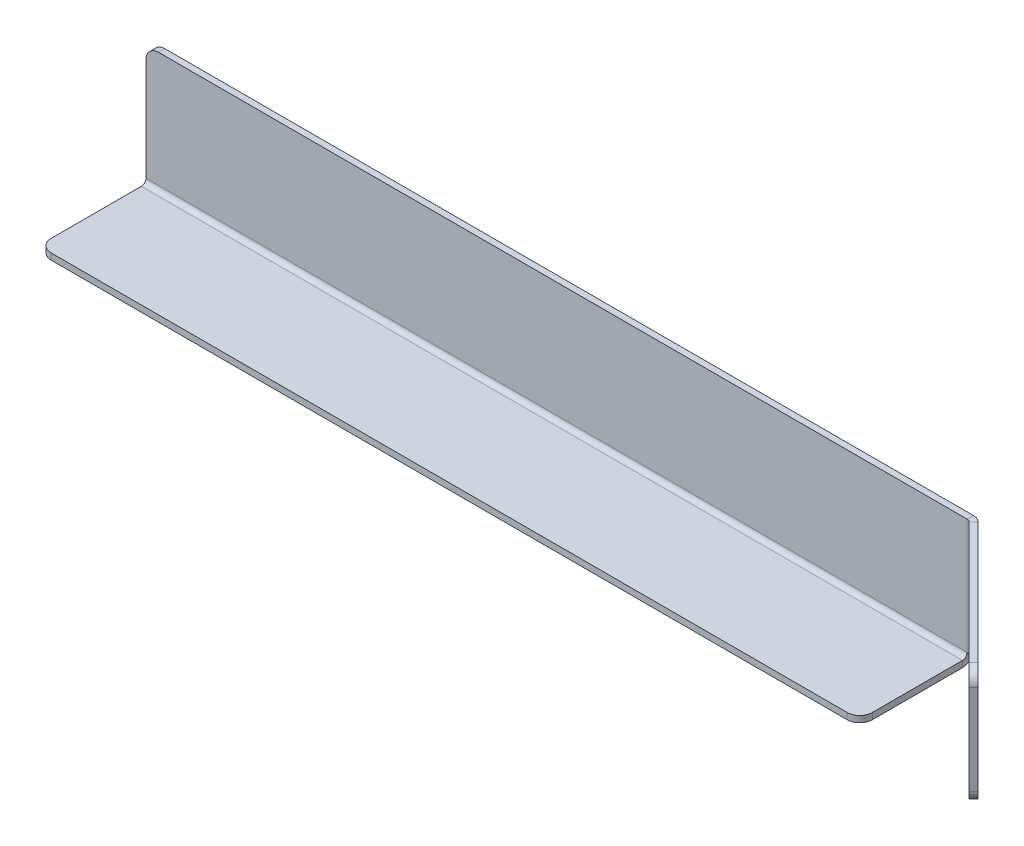
ISO-10303-21;
HEADER;
FILE_DESCRIPTION(('STEP AP214'),'2;1');
FILE_NAME('part.step','',(''),(''),'','','');
FILE_SCHEMA(('AUTOMOTIVE_DESIGN { 1 0 10303 214 1 1 1 1 }'));
ENDSEC;
DATA;
#1=APPLICATION_CONTEXT('core data for automotive mechanical design processes');
#2=APPLICATION_PROTOCOL_DEFINITION('international standard','automotive_design',2000,#1);
#3=PRODUCT_CONTEXT('',#1,'mechanical');
#4=PRODUCT('Part','Part','',(#3));
#5=PRODUCT_RELATED_PRODUCT_CATEGORY('part','',(#4));
#6=PRODUCT_DEFINITION_FORMATION('','',#4);
#7=PRODUCT_DEFINITION_CONTEXT('part definition',#1,'design');
#8=PRODUCT_DEFINITION('design','',#6,#7);
#9=PRODUCT_DEFINITION_SHAPE('','',#8);
#10=(LENGTH_UNIT() NAMED_UNIT(*) SI_UNIT(.MILLI.,.METRE.));
#11=(NAMED_UNIT(*) PLANE_ANGLE_UNIT() SI_UNIT($,.RADIAN.));
#12=(NAMED_UNIT(*) SI_UNIT($,.STERADIAN.) SOLID_ANGLE_UNIT());
#13=UNCERTAINTY_MEASURE_WITH_UNIT(LENGTH_MEASURE(1.E-05),#10,'distance_accuracy_value','');
#14=(GEOMETRIC_REPRESENTATION_CONTEXT(3) GLOBAL_UNCERTAINTY_ASSIGNED_CONTEXT((#13)) GLOBAL_UNIT_ASSIGNED_CONTEXT((#10,
#11,#12)) REPRESENTATION_CONTEXT('',''));
#15=CARTESIAN_POINT('',(0.,0.,0.));
#16=DIRECTION('',(0.,0.,1.));
#17=DIRECTION('',(1.,0.,0.));
#18=AXIS2_PLACEMENT_3D('',#15,#16,#17);
#19=CARTESIAN_POINT('',(0.,0.,-1.));
#20=DIRECTION('',(0.,0.,1.));
#21=DIRECTION('',(1.,0.,0.));
#22=AXIS2_PLACEMENT_3D('',#19,#20,#21);
#23=PLANE('',#22);
#24=DIRECTION('',(0.,-1.,0.));
#25=VECTOR('',#24,1.);
#26=CARTESIAN_POINT('',(-130.,0.,-1.));
#27=LINE('',#26,#25);
#28=CARTESIAN_POINT('',(-130.,18.,-1.));
#29=VERTEX_POINT('',#28);
#30=CARTESIAN_POINT('',(-130.,1.7366,-1.));
#31=VERTEX_POINT('',#30);
#32=EDGE_CURVE('E309',#29,#31,#27,.T.);
#33=ORIENTED_EDGE('',*,*,#32,.F.);
#34=CARTESIAN_POINT('',(-128.,18.,-1.));
#35=DIRECTION('',(0.,0.,1.));
#36=DIRECTION('',(1.,0.,0.));
#37=AXIS2_PLACEMENT_3D('',#34,#35,#36);
#38=CIRCLE('',#37,2.);
#39=CARTESIAN_POINT('',(-128.,20.,-1.));
#40=VERTEX_POINT('',#39);
#41=EDGE_CURVE('E343',#29,#40,#38,.F.);
#42=ORIENTED_EDGE('',*,*,#41,.T.);
#43=DIRECTION('',(-1.,0.,0.));
#44=VECTOR('',#43,1.);
#45=CARTESIAN_POINT('',(0.,20.,-1.));
#46=LINE('',#45,#44);
#47=CARTESIAN_POINT('',(0.,20.,-0.999999999999997));
#48=VERTEX_POINT('',#47);
#49=EDGE_CURVE('E305',#48,#40,#46,.T.);
#50=ORIENTED_EDGE('',*,*,#49,.F.);
#51=DIRECTION('',(0.,1.,0.));
#52=VECTOR('',#51,1.);
#53=CARTESIAN_POINT('',(0.,0.,-1.));
#54=LINE('',#53,#52);
#55=CARTESIAN_POINT('',(0.,1.73660000000001,-0.999999999999997));
#56=VERTEX_POINT('',#55);
#57=EDGE_CURVE('E210',#56,#48,#54,.T.);
#58=ORIENTED_EDGE('',*,*,#57,.F.);
#59=DIRECTION('',(1.,0.,0.));
#60=VECTOR('',#59,1.);
#61=CARTESIAN_POINT('',(0.,1.73660000000001,-0.999999999999997));
#62=LINE('',#61,#60);
#63=EDGE_CURVE('E280',#56,#31,#62,.F.);
#64=ORIENTED_EDGE('',*,*,#63,.T.);
#65=EDGE_LOOP('',(#33,#42,#50,#58,#64));
#66=FACE_BOUND('',#65,.T.);
#67=ADVANCED_FACE('F81',(#66),#23,.F.);
#68=CARTESIAN_POINT('',(0.,0.,0.));
#69=DIRECTION('',(0.,0.,1.));
#70=DIRECTION('',(1.,0.,0.));
#71=AXIS2_PLACEMENT_3D('',#68,#69,#70);
#72=PLANE('',#71);
#73=DIRECTION('',(-1.,0.,0.));
#74=VECTOR('',#73,1.);
#75=CARTESIAN_POINT('',(0.,20.,0.));
#76=LINE('',#75,#74);
#77=CARTESIAN_POINT('',(0.,20.,0.));
#78=VERTEX_POINT('',#77);
#79=CARTESIAN_POINT('',(-128.,20.,0.));
#80=VERTEX_POINT('',#79);
#81=EDGE_CURVE('E313',#78,#80,#76,.T.);
#82=ORIENTED_EDGE('',*,*,#81,.T.);
#83=CARTESIAN_POINT('',(-128.,18.,0.));
#84=DIRECTION('',(0.,0.,1.));
#85=DIRECTION('',(1.,0.,0.));
#86=AXIS2_PLACEMENT_3D('',#83,#84,#85);
#87=CIRCLE('',#86,2.);
#88=CARTESIAN_POINT('',(-130.,18.,0.));
#89=VERTEX_POINT('',#88);
#90=EDGE_CURVE('E339',#80,#89,#87,.T.);
#91=ORIENTED_EDGE('',*,*,#90,.T.);
#92=DIRECTION('',(0.,-1.,0.));
#93=VECTOR('',#92,1.);
#94=CARTESIAN_POINT('',(-130.,0.,0.));
#95=LINE('',#94,#93);
#96=CARTESIAN_POINT('',(-130.,1.7366,0.));
#97=VERTEX_POINT('',#96);
#98=EDGE_CURVE('E306',#89,#97,#95,.T.);
#99=ORIENTED_EDGE('',*,*,#98,.T.);
#100=DIRECTION('',(1.,0.,0.));
#101=VECTOR('',#100,1.);
#102=CARTESIAN_POINT('',(0.,1.7366,0.));
#103=LINE('',#102,#101);
#104=CARTESIAN_POINT('',(0.,1.7366,0.));
#105=VERTEX_POINT('',#104);
#106=EDGE_CURVE('E293',#105,#97,#103,.F.);
#107=ORIENTED_EDGE('',*,*,#106,.F.);
#108=DIRECTION('',(0.,1.,0.));
#109=VECTOR('',#108,1.);
#110=CARTESIAN_POINT('',(0.,0.,0.));
#111=LINE('',#110,#109);
#112=EDGE_CURVE('E301',#105,#78,#111,.T.);
#113=ORIENTED_EDGE('',*,*,#112,.T.);
#114=EDGE_LOOP('',(#82,#91,#99,#107,#113));
#115=FACE_BOUND('',#114,.T.);
#116=ADVANCED_FACE('F431',(#115),#72,.T.);
#117=CARTESIAN_POINT('',(-130.,0.,-1.));
#118=DIRECTION('',(-1.,0.,0.));
#119=DIRECTION('',(0.,0.,1.));
#120=AXIS2_PLACEMENT_3D('',#117,#118,#119);
#121=PLANE('',#120);
#122=ORIENTED_EDGE('',*,*,#98,.F.);
#123=DIRECTION('',(0.,0.,1.));
#124=VECTOR('',#123,1.);
#125=CARTESIAN_POINT('',(-130.,18.,-1.));
#126=LINE('',#125,#124);
#127=EDGE_CURVE('E341',#89,#29,#126,.F.);
#128=ORIENTED_EDGE('',*,*,#127,.T.);
#129=ORIENTED_EDGE('',*,*,#32,.T.);
#130=DIRECTION('',(0.,0.,-1.));
#131=VECTOR('',#130,1.);
#132=CARTESIAN_POINT('',(-130.,1.7366,0.));
#133=LINE('',#132,#131);
#134=EDGE_CURVE('E298',#97,#31,#133,.T.);
#135=ORIENTED_EDGE('',*,*,#134,.F.);
#136=EDGE_LOOP('',(#122,#128,#129,#135));
#137=FACE_BOUND('',#136,.T.);
#138=ADVANCED_FACE('F435',(#137),#121,.T.);
#139=CARTESIAN_POINT('',(0.,20.,-1.));
#140=DIRECTION('',(0.,1.,0.));
#141=DIRECTION('',(-1.,0.,0.));
#142=AXIS2_PLACEMENT_3D('',#139,#140,#141);
#143=PLANE('',#142);
#144=ORIENTED_EDGE('',*,*,#49,.T.);
#145=DIRECTION('',(0.,0.,1.));
#146=VECTOR('',#145,1.);
#147=CARTESIAN_POINT('',(-128.,20.,-1.));
#148=LINE('',#147,#146);
#149=EDGE_CURVE('E336',#40,#80,#148,.T.);
#150=ORIENTED_EDGE('',*,*,#149,.T.);
#151=ORIENTED_EDGE('',*,*,#81,.F.);
#152=DIRECTION('',(0.,0.,1.));
#153=VECTOR('',#152,1.);
#154=CARTESIAN_POINT('',(0.,20.,-1.));
#155=LINE('',#154,#153);
#156=EDGE_CURVE('E311',#48,#78,#155,.T.);
#157=ORIENTED_EDGE('',*,*,#156,.F.);
#158=EDGE_LOOP('',(#144,#150,#151,#157));
#159=FACE_BOUND('',#158,.T.);
#160=ADVANCED_FACE('F429',(#159),#143,.T.);
#161=CARTESIAN_POINT('',(-130.,1.73659999999999,0.7366));
#162=DIRECTION('',(-1.,0.,0.));
#163=DIRECTION('',(0.,0.,1.));
#164=AXIS2_PLACEMENT_3D('',#161,#162,#163);
#165=PLANE('',#164);
#166=DIRECTION('',(0.,1.,0.));
#167=VECTOR('',#166,1.);
#168=CARTESIAN_POINT('',(-130.,0.,0.736599999999994));
#169=LINE('',#168,#167);
#170=CARTESIAN_POINT('',(-130.,0.999999999999985,0.736599999999997));
#171=VERTEX_POINT('',#170);
#172=CARTESIAN_POINT('',(-130.,0.,0.736599999999994));
#173=VERTEX_POINT('',#172);
#174=EDGE_CURVE('E248',#171,#173,#169,.F.);
#175=ORIENTED_EDGE('',*,*,#174,.F.);
#176=CARTESIAN_POINT('',(-130.,1.73659999999999,0.7366));
#177=DIRECTION('',(1.,0.,0.));
#178=DIRECTION('',(0.,0.,-1.));
#179=AXIS2_PLACEMENT_3D('',#176,#177,#178);
#180=CIRCLE('',#179,0.736600000000006);
#181=EDGE_CURVE('E290',#97,#171,#180,.F.);
#182=ORIENTED_EDGE('',*,*,#181,.F.);
#183=ORIENTED_EDGE('',*,*,#134,.T.);
#184=CARTESIAN_POINT('',(-130.,1.73659999999999,0.7366));
#185=DIRECTION('',(1.,0.,0.));
#186=DIRECTION('',(0.,0.,-1.));
#187=AXIS2_PLACEMENT_3D('',#184,#185,#186);
#188=CIRCLE('',#187,1.73660000000001);
#189=EDGE_CURVE('E283',#31,#173,#188,.F.);
#190=ORIENTED_EDGE('',*,*,#189,.T.);
#191=EDGE_LOOP('',(#175,#182,#183,#190));
#192=FACE_BOUND('',#191,.T.);
#193=ADVANCED_FACE('F416',(#192),#165,.T.);
#194=CARTESIAN_POINT('',(0.,1.73659999999999,0.736600000000009));
#195=DIRECTION('',(-1.,0.,0.));
#196=DIRECTION('',(0.,0.,1.));
#197=AXIS2_PLACEMENT_3D('',#194,#195,#196);
#198=PLANE('',#197);
#199=CARTESIAN_POINT('',(0.,1.73659999999999,0.736600000000009));
#200=DIRECTION('',(1.,0.,0.));
#201=DIRECTION('',(0.,0.,-1.));
#202=AXIS2_PLACEMENT_3D('',#199,#200,#201);
#203=CIRCLE('',#202,0.736600000000006);
#204=CARTESIAN_POINT('',(0.,0.999999999999985,0.736600000000007));
#205=VERTEX_POINT('',#204);
#206=EDGE_CURVE('E255',#205,#105,#203,.T.);
#207=ORIENTED_EDGE('',*,*,#206,.F.);
#208=DIRECTION('',(0.,1.,0.));
#209=VECTOR('',#208,1.);
#210=CARTESIAN_POINT('',(0.,0.999999999999997,0.736600000000007));
#211=LINE('',#210,#209);
#212=CARTESIAN_POINT('',(0.,0.,0.736600000000003));
#213=VERTEX_POINT('',#212);
#214=EDGE_CURVE('E273',#205,#213,#211,.F.);
#215=ORIENTED_EDGE('',*,*,#214,.T.);
#216=CARTESIAN_POINT('',(0.,1.73659999999999,0.736600000000009));
#217=DIRECTION('',(1.,0.,0.));
#218=DIRECTION('',(0.,0.,-1.));
#219=AXIS2_PLACEMENT_3D('',#216,#217,#218);
#220=CIRCLE('',#219,1.73660000000001);
#221=EDGE_CURVE('E284',#213,#56,#220,.T.);
#222=ORIENTED_EDGE('',*,*,#221,.T.);
#223=DIRECTION('',(0.,0.,-1.));
#224=VECTOR('',#223,1.);
#225=CARTESIAN_POINT('',(0.,1.7366,0.));
#226=LINE('',#225,#224);
#227=EDGE_CURVE('E287',#105,#56,#226,.T.);
#228=ORIENTED_EDGE('',*,*,#227,.F.);
#229=EDGE_LOOP('',(#207,#215,#222,#228));
#230=FACE_BOUND('',#229,.T.);
#231=ADVANCED_FACE('F381',(#230),#198,.F.);
#232=CARTESIAN_POINT('',(0.,1.73659999999999,0.736600000000009));
#233=DIRECTION('',(1.,0.,0.));
#234=DIRECTION('',(0.,-1.,0.));
#235=AXIS2_PLACEMENT_3D('',#232,#233,#234);
#236=CYLINDRICAL_SURFACE('',#235,1.73660000000001);
#237=ORIENTED_EDGE('',*,*,#63,.F.);
#238=ORIENTED_EDGE('',*,*,#221,.F.);
#239=DIRECTION('',(1.,0.,0.));
#240=VECTOR('',#239,1.);
#241=CARTESIAN_POINT('',(-130.,0.,0.736599999999994));
#242=LINE('',#241,#240);
#243=EDGE_CURVE('E270',#213,#173,#242,.F.);
#244=ORIENTED_EDGE('',*,*,#243,.T.);
#245=ORIENTED_EDGE('',*,*,#189,.F.);
#246=EDGE_LOOP('',(#237,#238,#244,#245));
#247=FACE_BOUND('',#246,.T.);
#248=ADVANCED_FACE('F421',(#247),#236,.T.);
#249=CARTESIAN_POINT('',(0.,1.73659999999999,0.736600000000009));
#250=DIRECTION('',(1.,0.,0.));
#251=DIRECTION('',(0.,-1.,0.));
#252=AXIS2_PLACEMENT_3D('',#249,#250,#251);
#253=CYLINDRICAL_SURFACE('',#252,0.736600000000006);
#254=ORIENTED_EDGE('',*,*,#106,.T.);
#255=ORIENTED_EDGE('',*,*,#181,.T.);
#256=DIRECTION('',(1.,0.,0.));
#257=VECTOR('',#256,1.);
#258=CARTESIAN_POINT('',(-130.,0.999999999999985,0.736599999999997));
#259=LINE('',#258,#257);
#260=EDGE_CURVE('E276',#171,#205,#259,.T.);
#261=ORIENTED_EDGE('',*,*,#260,.T.);
#262=ORIENTED_EDGE('',*,*,#206,.T.);
#263=EDGE_LOOP('',(#254,#255,#261,#262));
#264=FACE_BOUND('',#263,.T.);
#265=ADVANCED_FACE('F384',(#264),#253,.F.);
#266=CARTESIAN_POINT('',(0.,0.,17.));
#267=DIRECTION('',(-1.,0.,0.));
#268=DIRECTION('',(0.,-1.,0.));
#269=AXIS2_PLACEMENT_3D('',#266,#267,#268);
#270=PLANE('',#269);
#271=DIRECTION('',(0.,0.,-1.));
#272=VECTOR('',#271,1.);
#273=CARTESIAN_POINT('',(0.,0.999999999999941,17.));
#274=LINE('',#273,#272);
#275=CARTESIAN_POINT('',(0.,0.999999999999948,15.));
#276=VERTEX_POINT('',#275);
#277=EDGE_CURVE('E267',#205,#276,#274,.F.);
#278=ORIENTED_EDGE('',*,*,#277,.T.);
#279=DIRECTION('',(0.,1.,0.));
#280=VECTOR('',#279,1.);
#281=CARTESIAN_POINT('',(0.,0.,15.));
#282=LINE('',#281,#280);
#283=CARTESIAN_POINT('',(0.,0.,15.));
#284=VERTEX_POINT('',#283);
#285=EDGE_CURVE('E327',#276,#284,#282,.F.);
#286=ORIENTED_EDGE('',*,*,#285,.T.);
#287=DIRECTION('',(0.,0.,1.));
#288=VECTOR('',#287,1.);
#289=CARTESIAN_POINT('',(0.,0.,0.));
#290=LINE('',#289,#288);
#291=EDGE_CURVE('E259',#213,#284,#290,.T.);
#292=ORIENTED_EDGE('',*,*,#291,.F.);
#293=ORIENTED_EDGE('',*,*,#214,.F.);
#294=EDGE_LOOP('',(#278,#286,#292,#293));
#295=FACE_BOUND('',#294,.T.);
#296=ADVANCED_FACE('F394',(#295),#270,.F.);
#297=CARTESIAN_POINT('',(-130.,0.,0.));
#298=DIRECTION('',(1.,0.,0.));
#299=DIRECTION('',(0.,1.,0.));
#300=AXIS2_PLACEMENT_3D('',#297,#298,#299);
#301=PLANE('',#300);
#302=DIRECTION('',(0.,0.,-1.));
#303=VECTOR('',#302,1.);
#304=CARTESIAN_POINT('',(-130.,0.,0.));
#305=LINE('',#304,#303);
#306=CARTESIAN_POINT('',(-130.,0.,15.));
#307=VERTEX_POINT('',#306);
#308=EDGE_CURVE('E253',#307,#173,#305,.T.);
#309=ORIENTED_EDGE('',*,*,#308,.F.);
#310=DIRECTION('',(0.,1.,0.));
#311=VECTOR('',#310,1.);
#312=CARTESIAN_POINT('',(-130.,0.,15.));
#313=LINE('',#312,#311);
#314=CARTESIAN_POINT('',(-130.,0.999999999999935,15.));
#315=VERTEX_POINT('',#314);
#316=EDGE_CURVE('E333',#307,#315,#313,.T.);
#317=ORIENTED_EDGE('',*,*,#316,.T.);
#318=DIRECTION('',(0.,0.,1.));
#319=VECTOR('',#318,1.);
#320=CARTESIAN_POINT('',(-130.,0.999999999999988,0.));
#321=LINE('',#320,#319);
#322=EDGE_CURVE('E262',#315,#171,#321,.F.);
#323=ORIENTED_EDGE('',*,*,#322,.T.);
#324=ORIENTED_EDGE('',*,*,#174,.T.);
#325=EDGE_LOOP('',(#309,#317,#323,#324));
#326=FACE_BOUND('',#325,.T.);
#327=ADVANCED_FACE('F413',(#326),#301,.F.);
#328=CARTESIAN_POINT('',(0.,0.,0.));
#329=DIRECTION('',(0.,1.,0.));
#330=DIRECTION('',(0.,0.,1.));
#331=AXIS2_PLACEMENT_3D('',#328,#329,#330);
#332=PLANE('',#331);
#333=ORIENTED_EDGE('',*,*,#291,.T.);
#334=CARTESIAN_POINT('',(-2.,0.,15.));
#335=DIRECTION('',(0.,1.,0.));
#336=DIRECTION('',(0.,0.,1.));
#337=AXIS2_PLACEMENT_3D('',#334,#335,#336);
#338=CIRCLE('',#337,2.);
#339=CARTESIAN_POINT('',(-2.,0.,17.));
#340=VERTEX_POINT('',#339);
#341=EDGE_CURVE('E331',#284,#340,#338,.F.);
#342=ORIENTED_EDGE('',*,*,#341,.T.);
#343=DIRECTION('',(-1.,0.,0.));
#344=VECTOR('',#343,1.);
#345=CARTESIAN_POINT('',(0.,0.,17.));
#346=LINE('',#345,#344);
#347=CARTESIAN_POINT('',(-128.,0.,17.));
#348=VERTEX_POINT('',#347);
#349=EDGE_CURVE('E256',#340,#348,#346,.T.);
#350=ORIENTED_EDGE('',*,*,#349,.T.);
#351=CARTESIAN_POINT('',(-128.,0.,15.));
#352=DIRECTION('',(0.,1.,0.));
#353=DIRECTION('',(0.,0.,1.));
#354=AXIS2_PLACEMENT_3D('',#351,#352,#353);
#355=CIRCLE('',#354,2.);
#356=EDGE_CURVE('E329',#348,#307,#355,.F.);
#357=ORIENTED_EDGE('',*,*,#356,.T.);
#358=ORIENTED_EDGE('',*,*,#308,.T.);
#359=ORIENTED_EDGE('',*,*,#243,.F.);
#360=EDGE_LOOP('',(#333,#342,#350,#357,#358,#359));
#361=FACE_BOUND('',#360,.T.);
#362=ADVANCED_FACE('F402',(#361),#332,.F.);
#363=CARTESIAN_POINT('',(0.,1.,0.));
#364=DIRECTION('',(0.,1.,0.));
#365=DIRECTION('',(0.,0.,1.));
#366=AXIS2_PLACEMENT_3D('',#363,#364,#365);
#367=PLANE('',#366);
#368=DIRECTION('',(1.,0.,0.));
#369=VECTOR('',#368,1.);
#370=CARTESIAN_POINT('',(-130.,0.999999999999929,17.));
#371=LINE('',#370,#369);
#372=CARTESIAN_POINT('',(-2.,0.999999999999941,17.));
#373=VERTEX_POINT('',#372);
#374=CARTESIAN_POINT('',(-128.,0.999999999999929,17.));
#375=VERTEX_POINT('',#374);
#376=EDGE_CURVE('E264',#373,#375,#371,.F.);
#377=ORIENTED_EDGE('',*,*,#376,.F.);
#378=CARTESIAN_POINT('',(-2.,0.999999999999947,15.));
#379=DIRECTION('',(0.,1.,0.));
#380=DIRECTION('',(0.,0.,1.));
#381=AXIS2_PLACEMENT_3D('',#378,#379,#380);
#382=CIRCLE('',#381,2.);
#383=EDGE_CURVE('E325',#373,#276,#382,.T.);
#384=ORIENTED_EDGE('',*,*,#383,.T.);
#385=ORIENTED_EDGE('',*,*,#277,.F.);
#386=ORIENTED_EDGE('',*,*,#260,.F.);
#387=ORIENTED_EDGE('',*,*,#322,.F.);
#388=CARTESIAN_POINT('',(-128.,0.999999999999935,15.));
#389=DIRECTION('',(0.,1.,0.));
#390=DIRECTION('',(0.,0.,1.));
#391=AXIS2_PLACEMENT_3D('',#388,#389,#390);
#392=CIRCLE('',#391,2.);
#393=EDGE_CURVE('E323',#315,#375,#392,.T.);
#394=ORIENTED_EDGE('',*,*,#393,.T.);
#395=EDGE_LOOP('',(#377,#384,#385,#386,#387,#394));
#396=FACE_BOUND('',#395,.T.);
#397=ADVANCED_FACE('F391',(#396),#367,.T.);
#398=CARTESIAN_POINT('',(-130.,0.,17.));
#399=DIRECTION('',(0.,0.,-1.));
#400=DIRECTION('',(0.,1.,0.));
#401=AXIS2_PLACEMENT_3D('',#398,#399,#400);
#402=PLANE('',#401);
#403=ORIENTED_EDGE('',*,*,#349,.F.);
#404=DIRECTION('',(0.,1.,0.));
#405=VECTOR('',#404,1.);
#406=CARTESIAN_POINT('',(-2.,0.,17.));
#407=LINE('',#406,#405);
#408=EDGE_CURVE('E320',#340,#373,#407,.T.);
#409=ORIENTED_EDGE('',*,*,#408,.T.);
#410=ORIENTED_EDGE('',*,*,#376,.T.);
#411=DIRECTION('',(0.,1.,0.));
#412=VECTOR('',#411,1.);
#413=CARTESIAN_POINT('',(-128.,0.,17.));
#414=LINE('',#413,#412);
#415=EDGE_CURVE('E318',#375,#348,#414,.F.);
#416=ORIENTED_EDGE('',*,*,#415,.T.);
#417=EDGE_LOOP('',(#403,#409,#410,#416));
#418=FACE_BOUND('',#417,.T.);
#419=ADVANCED_FACE('F406',(#418),#402,.F.);
#420=CARTESIAN_POINT('',(0.,1.7366,0.736599999999999));
#421=DIRECTION('',(0.,-1.,0.));
#422=DIRECTION('',(0.,0.,-1.));
#423=AXIS2_PLACEMENT_3D('',#420,#421,#422);
#424=PLANE('',#423);
#425=DIRECTION('',(-0.707106781186544,0.,0.707106781186551));
#426=VECTOR('',#425,1.);
#427=CARTESIAN_POINT('',(1.22796163620855,1.7366,-0.491361636208565));
#428=LINE('',#427,#426);
#429=CARTESIAN_POINT('',(0.520854855022008,1.7366,0.215745144977987));
#430=VERTEX_POINT('',#429);
#431=CARTESIAN_POINT('',(1.22796163620855,1.7366,-0.491361636208565));
#432=VERTEX_POINT('',#431);
#433=EDGE_CURVE('E245',#430,#432,#428,.F.);
#434=ORIENTED_EDGE('',*,*,#433,.F.);
#435=CARTESIAN_POINT('',(0.,1.7366,0.736599999999999));
#436=DIRECTION('',(0.,1.,0.));
#437=DIRECTION('',(0.,0.,1.));
#438=AXIS2_PLACEMENT_3D('',#435,#436,#437);
#439=CIRCLE('',#438,0.736599999999999);
#440=EDGE_CURVE('E214',#105,#430,#439,.F.);
#441=ORIENTED_EDGE('',*,*,#440,.F.);
#442=ORIENTED_EDGE('',*,*,#227,.T.);
#443=CARTESIAN_POINT('',(0.,1.7366,0.736599999999999));
#444=DIRECTION('',(0.,1.,0.));
#445=DIRECTION('',(0.,0.,1.));
#446=AXIS2_PLACEMENT_3D('',#443,#444,#445);
#447=CIRCLE('',#446,1.7366);
#448=EDGE_CURVE('E213',#56,#432,#447,.F.);
#449=ORIENTED_EDGE('',*,*,#448,.T.);
#450=EDGE_LOOP('',(#434,#441,#442,#449));
#451=FACE_BOUND('',#450,.T.);
#452=ADVANCED_FACE('F377',(#451),#424,.T.);
#453=CARTESIAN_POINT('',(0.,20.,0.736600000000002));
#454=DIRECTION('',(0.,-1.,0.));
#455=DIRECTION('',(0.,0.,-1.));
#456=AXIS2_PLACEMENT_3D('',#453,#454,#455);
#457=PLANE('',#456);
#458=CARTESIAN_POINT('',(0.,20.,0.736600000000002));
#459=DIRECTION('',(0.,1.,0.));
#460=DIRECTION('',(0.,0.,1.));
#461=AXIS2_PLACEMENT_3D('',#458,#459,#460);
#462=CIRCLE('',#461,0.736599999999999);
#463=CARTESIAN_POINT('',(0.520854855022008,20.,0.215745144977989));
#464=VERTEX_POINT('',#463);
#465=EDGE_CURVE('E221',#464,#78,#462,.T.);
#466=ORIENTED_EDGE('',*,*,#465,.F.);
#467=DIRECTION('',(-0.707106781186544,0.,0.707106781186551));
#468=VECTOR('',#467,1.);
#469=CARTESIAN_POINT('',(0.52085485502201,20.,0.215745144977987));
#470=LINE('',#469,#468);
#471=CARTESIAN_POINT('',(1.22796163620855,20.,-0.491361636208564));
#472=VERTEX_POINT('',#471);
#473=EDGE_CURVE('E218',#464,#472,#470,.F.);
#474=ORIENTED_EDGE('',*,*,#473,.T.);
#475=CARTESIAN_POINT('',(0.,20.,0.736600000000002));
#476=DIRECTION('',(0.,1.,0.));
#477=DIRECTION('',(0.,0.,1.));
#478=AXIS2_PLACEMENT_3D('',#475,#476,#477);
#479=CIRCLE('',#478,1.7366);
#480=EDGE_CURVE('E203',#472,#48,#479,.T.);
#481=ORIENTED_EDGE('',*,*,#480,.T.);
#482=ORIENTED_EDGE('',*,*,#156,.T.);
#483=EDGE_LOOP('',(#466,#474,#481,#482));
#484=FACE_BOUND('',#483,.T.);
#485=ADVANCED_FACE('F219',(#484),#457,.F.);
#486=CARTESIAN_POINT('',(0.,20.,0.736600000000002));
#487=DIRECTION('',(0.,1.,0.));
#488=DIRECTION('',(0.707106781186544,0.,-0.707106781186551));
#489=AXIS2_PLACEMENT_3D('',#486,#487,#488);
#490=CYLINDRICAL_SURFACE('',#489,1.7366);
#491=ORIENTED_EDGE('',*,*,#57,.T.);
#492=ORIENTED_EDGE('',*,*,#480,.F.);
#493=DIRECTION('',(0.,1.,0.));
#494=VECTOR('',#493,1.);
#495=CARTESIAN_POINT('',(1.22796163620855,1.7366,-0.491361636208565));
#496=LINE('',#495,#494);
#497=EDGE_CURVE('E208',#472,#432,#496,.F.);
#498=ORIENTED_EDGE('',*,*,#497,.T.);
#499=ORIENTED_EDGE('',*,*,#448,.F.);
#500=EDGE_LOOP('',(#491,#492,#498,#499));
#501=FACE_BOUND('',#500,.T.);
#502=ADVANCED_FACE('F205',(#501),#490,.T.);
#503=CARTESIAN_POINT('',(0.,20.,0.736600000000002));
#504=DIRECTION('',(0.,1.,0.));
#505=DIRECTION('',(0.707106781186544,0.,-0.707106781186551));
#506=AXIS2_PLACEMENT_3D('',#503,#504,#505);
#507=CYLINDRICAL_SURFACE('',#506,0.736599999999999);
#508=ORIENTED_EDGE('',*,*,#112,.F.);
#509=ORIENTED_EDGE('',*,*,#440,.T.);
#510=DIRECTION('',(0.,1.,0.));
#511=VECTOR('',#510,1.);
#512=CARTESIAN_POINT('',(0.520854855022008,1.7366,0.215745144977987));
#513=LINE('',#512,#511);
#514=EDGE_CURVE('E223',#430,#464,#513,.T.);
#515=ORIENTED_EDGE('',*,*,#514,.T.);
#516=ORIENTED_EDGE('',*,*,#465,.T.);
#517=EDGE_LOOP('',(#508,#509,#515,#516));
#518=FACE_BOUND('',#517,.T.);
#519=ADVANCED_FACE('F374',(#518),#507,.F.);
#520=CARTESIAN_POINT('',(21.9325267080136,20.,20.2132034355963));
#521=DIRECTION('',(0.,-1.,0.));
#522=DIRECTION('',(1.,0.,0.));
#523=AXIS2_PLACEMENT_3D('',#520,#521,#522);
#524=PLANE('',#523);
#525=DIRECTION('',(-0.707106781186551,0.,-0.707106781186544));
#526=VECTOR('',#525,1.);
#527=CARTESIAN_POINT('',(21.2254199268271,20.,20.9203102167829));
#528=LINE('',#527,#526);
#529=CARTESIAN_POINT('',(19.811206364454,20.,19.5060966544098));
#530=VERTEX_POINT('',#529);
#531=EDGE_CURVE('E231',#464,#530,#528,.F.);
#532=ORIENTED_EDGE('',*,*,#531,.T.);
#533=DIRECTION('',(-0.707106781186544,0.,0.707106781186551));
#534=VECTOR('',#533,1.);
#535=CARTESIAN_POINT('',(20.5183131456405,20.,18.7989898732232));
#536=LINE('',#535,#534);
#537=CARTESIAN_POINT('',(20.5183131456406,20.,18.7989898732232));
#538=VERTEX_POINT('',#537);
#539=EDGE_CURVE('E13',#530,#538,#536,.F.);
#540=ORIENTED_EDGE('',*,*,#539,.T.);
#541=DIRECTION('',(0.707106781186551,0.,0.707106781186544));
#542=VECTOR('',#541,1.);
#543=CARTESIAN_POINT('',(1.01221649123057,20.,-0.70710678118655));
#544=LINE('',#543,#542);
#545=EDGE_CURVE('E227',#472,#538,#544,.T.);
#546=ORIENTED_EDGE('',*,*,#545,.F.);
#547=ORIENTED_EDGE('',*,*,#473,.F.);
#548=EDGE_LOOP('',(#532,#540,#546,#547));
#549=FACE_BOUND('',#548,.T.);
#550=ADVANCED_FACE('F233',(#549),#524,.F.);
#551=CARTESIAN_POINT('',(1.01221649123056,1.7366,-0.707106781186551));
#552=DIRECTION('',(0.,1.,0.));
#553=DIRECTION('',(-1.,0.,0.));
#554=AXIS2_PLACEMENT_3D('',#551,#552,#553);
#555=PLANE('',#554);
#556=DIRECTION('',(-0.707106781186551,0.,-0.707106781186544));
#557=VECTOR('',#556,1.);
#558=CARTESIAN_POINT('',(1.01221649123056,1.7366,-0.707106781186551));
#559=LINE('',#558,#557);
#560=CARTESIAN_POINT('',(20.5183131456405,1.7366,18.7989898732232));
#561=VERTEX_POINT('',#560);
#562=EDGE_CURVE('E230',#561,#432,#559,.T.);
#563=ORIENTED_EDGE('',*,*,#562,.F.);
#564=DIRECTION('',(-0.707106781186544,0.,0.707106781186551));
#565=VECTOR('',#564,1.);
#566=CARTESIAN_POINT('',(20.5183131456405,1.7366,18.7989898732232));
#567=LINE('',#566,#565);
#568=CARTESIAN_POINT('',(19.811206364454,1.7366,19.5060966544098));
#569=VERTEX_POINT('',#568);
#570=EDGE_CURVE('E345',#561,#569,#567,.T.);
#571=ORIENTED_EDGE('',*,*,#570,.T.);
#572=DIRECTION('',(0.707106781186551,0.,0.707106781186544));
#573=VECTOR('',#572,1.);
#574=CARTESIAN_POINT('',(0.305109710044019,1.7366,0.));
#575=LINE('',#574,#573);
#576=EDGE_CURVE('E235',#569,#430,#575,.F.);
#577=ORIENTED_EDGE('',*,*,#576,.T.);
#578=ORIENTED_EDGE('',*,*,#433,.T.);
#579=EDGE_LOOP('',(#563,#571,#577,#578));
#580=FACE_BOUND('',#579,.T.);
#581=ADVANCED_FACE('F361',(#580),#555,.F.);
#582=CARTESIAN_POINT('',(1.01221649123056,0.,-0.707106781186551));
#583=DIRECTION('',(-0.707106781186544,0.,0.707106781186551));
#584=DIRECTION('',(0.707106781186551,0.,0.707106781186544));
#585=AXIS2_PLACEMENT_3D('',#582,#583,#584);
#586=PLANE('',#585);
#587=DIRECTION('',(0.,-1.,0.));
#588=VECTOR('',#587,1.);
#589=CARTESIAN_POINT('',(21.9325267080137,0.,20.2132034355963));
#590=LINE('',#589,#588);
#591=CARTESIAN_POINT('',(21.9325267080137,18.,20.2132034355963));
#592=VERTEX_POINT('',#591);
#593=CARTESIAN_POINT('',(21.9325267080137,3.7366,20.2132034355963));
#594=VERTEX_POINT('',#593);
#595=EDGE_CURVE('E234',#592,#594,#590,.T.);
#596=ORIENTED_EDGE('',*,*,#595,.T.);
#597=CARTESIAN_POINT('',(20.5183131456405,3.7366,18.7989898732232));
#598=DIRECTION('',(-0.707106781186544,0.,0.707106781186551));
#599=DIRECTION('',(0.707106781186551,0.,0.707106781186544));
#600=AXIS2_PLACEMENT_3D('',#597,#598,#599);
#601=CIRCLE('',#600,2.);
#602=EDGE_CURVE('E89',#594,#561,#601,.F.);
#603=ORIENTED_EDGE('',*,*,#602,.T.);
#604=ORIENTED_EDGE('',*,*,#562,.T.);
#605=ORIENTED_EDGE('',*,*,#497,.F.);
#606=ORIENTED_EDGE('',*,*,#545,.T.);
#607=CARTESIAN_POINT('',(20.5183131456405,18.,18.7989898732232));
#608=DIRECTION('',(-0.707106781186544,0.,0.707106781186551));
#609=DIRECTION('',(0.707106781186551,0.,0.707106781186544));
#610=AXIS2_PLACEMENT_3D('',#607,#608,#609);
#611=CIRCLE('',#610,2.);
#612=EDGE_CURVE('E356',#538,#592,#611,.F.);
#613=ORIENTED_EDGE('',*,*,#612,.T.);
#614=EDGE_LOOP('',(#596,#603,#604,#605,#606,#613));
#615=FACE_BOUND('',#614,.T.);
#616=ADVANCED_FACE('F226',(#615),#586,.F.);
#617=CARTESIAN_POINT('',(0.305109710044019,0.,0.));
#618=DIRECTION('',(-0.707106781186544,0.,0.707106781186551));
#619=DIRECTION('',(0.707106781186551,0.,0.707106781186544));
#620=AXIS2_PLACEMENT_3D('',#617,#618,#619);
#621=PLANE('',#620);
#622=ORIENTED_EDGE('',*,*,#576,.F.);
#623=CARTESIAN_POINT('',(19.811206364454,3.7366,19.5060966544098));
#624=DIRECTION('',(-0.707106781186544,0.,0.707106781186551));
#625=DIRECTION('',(0.707106781186551,0.,0.707106781186544));
#626=AXIS2_PLACEMENT_3D('',#623,#624,#625);
#627=CIRCLE('',#626,2.);
#628=CARTESIAN_POINT('',(21.2254199268271,3.7366,20.9203102167829));
#629=VERTEX_POINT('',#628);
#630=EDGE_CURVE('E350',#569,#629,#627,.T.);
#631=ORIENTED_EDGE('',*,*,#630,.T.);
#632=DIRECTION('',(0.,1.,0.));
#633=VECTOR('',#632,1.);
#634=CARTESIAN_POINT('',(21.2254199268271,1.7366,20.9203102167829));
#635=LINE('',#634,#633);
#636=CARTESIAN_POINT('',(21.2254199268271,18.,20.9203102167829));
#637=VERTEX_POINT('',#636);
#638=EDGE_CURVE('E238',#637,#629,#635,.F.);
#639=ORIENTED_EDGE('',*,*,#638,.F.);
#640=CARTESIAN_POINT('',(19.811206364454,18.,19.5060966544098));
#641=DIRECTION('',(-0.707106781186544,0.,0.707106781186551));
#642=DIRECTION('',(0.707106781186551,0.,0.707106781186544));
#643=AXIS2_PLACEMENT_3D('',#640,#641,#642);
#644=CIRCLE('',#643,2.);
#645=EDGE_CURVE('E348',#637,#530,#644,.T.);
#646=ORIENTED_EDGE('',*,*,#645,.T.);
#647=ORIENTED_EDGE('',*,*,#531,.F.);
#648=ORIENTED_EDGE('',*,*,#514,.F.);
#649=EDGE_LOOP('',(#622,#631,#639,#646,#647,#648));
#650=FACE_BOUND('',#649,.T.);
#651=ADVANCED_FACE('F367',(#650),#621,.T.);
#652=CARTESIAN_POINT('',(21.9325267080136,1.7366,20.2132034355963));
#653=DIRECTION('',(-0.707106781186551,0.,-0.707106781186544));
#654=DIRECTION('',(-0.707106781186544,0.,0.707106781186551));
#655=AXIS2_PLACEMENT_3D('',#652,#653,#654);
#656=PLANE('',#655);
#657=ORIENTED_EDGE('',*,*,#638,.T.);
#658=DIRECTION('',(-0.707106781186544,0.,0.707106781186551));
#659=VECTOR('',#658,1.);
#660=CARTESIAN_POINT('',(21.9325267080136,3.7366,20.2132034355963));
#661=LINE('',#660,#659);
#662=EDGE_CURVE('E102',#629,#594,#661,.F.);
#663=ORIENTED_EDGE('',*,*,#662,.T.);
#664=ORIENTED_EDGE('',*,*,#595,.F.);
#665=DIRECTION('',(-0.707106781186544,0.,0.707106781186551));
#666=VECTOR('',#665,1.);
#667=CARTESIAN_POINT('',(21.9325267080136,18.,20.2132034355963));
#668=LINE('',#667,#666);
#669=EDGE_CURVE('E352',#592,#637,#668,.T.);
#670=ORIENTED_EDGE('',*,*,#669,.T.);
#671=EDGE_LOOP('',(#657,#663,#664,#670));
#672=FACE_BOUND('',#671,.T.);
#673=ADVANCED_FACE('F369',(#672),#656,.F.);
#674=CARTESIAN_POINT('',(-2.,0.,15.));
#675=DIRECTION('',(0.,1.,0.));
#676=DIRECTION('',(0.,0.,1.));
#677=AXIS2_PLACEMENT_3D('',#674,#675,#676);
#678=CYLINDRICAL_SURFACE('',#677,2.);
#679=ORIENTED_EDGE('',*,*,#341,.F.);
#680=ORIENTED_EDGE('',*,*,#285,.F.);
#681=ORIENTED_EDGE('',*,*,#383,.F.);
#682=ORIENTED_EDGE('',*,*,#408,.F.);
#683=EDGE_LOOP('',(#679,#680,#681,#682));
#684=FACE_BOUND('',#683,.T.);
#685=ADVANCED_FACE('F398',(#684),#678,.T.);
#686=CARTESIAN_POINT('',(-128.,0.,15.));
#687=DIRECTION('',(0.,1.,0.));
#688=DIRECTION('',(0.,0.,1.));
#689=AXIS2_PLACEMENT_3D('',#686,#687,#688);
#690=CYLINDRICAL_SURFACE('',#689,2.);
#691=ORIENTED_EDGE('',*,*,#356,.F.);
#692=ORIENTED_EDGE('',*,*,#415,.F.);
#693=ORIENTED_EDGE('',*,*,#393,.F.);
#694=ORIENTED_EDGE('',*,*,#316,.F.);
#695=EDGE_LOOP('',(#691,#692,#693,#694));
#696=FACE_BOUND('',#695,.T.);
#697=ADVANCED_FACE('F409',(#696),#690,.T.);
#698=CARTESIAN_POINT('',(-128.,18.,-1.));
#699=DIRECTION('',(0.,0.,1.));
#700=DIRECTION('',(1.,0.,0.));
#701=AXIS2_PLACEMENT_3D('',#698,#699,#700);
#702=CYLINDRICAL_SURFACE('',#701,2.);
#703=ORIENTED_EDGE('',*,*,#41,.F.);
#704=ORIENTED_EDGE('',*,*,#127,.F.);
#705=ORIENTED_EDGE('',*,*,#90,.F.);
#706=ORIENTED_EDGE('',*,*,#149,.F.);
#707=EDGE_LOOP('',(#703,#704,#705,#706));
#708=FACE_BOUND('',#707,.T.);
#709=ADVANCED_FACE('F437',(#708),#702,.T.);
#710=CARTESIAN_POINT('',(20.5183131456405,3.7366,18.7989898732232));
#711=DIRECTION('',(-0.707106781186544,0.,0.707106781186551));
#712=DIRECTION('',(0.707106781186551,0.,0.707106781186544));
#713=AXIS2_PLACEMENT_3D('',#710,#711,#712);
#714=CYLINDRICAL_SURFACE('',#713,2.);
#715=ORIENTED_EDGE('',*,*,#602,.F.);
#716=ORIENTED_EDGE('',*,*,#662,.F.);
#717=ORIENTED_EDGE('',*,*,#630,.F.);
#718=ORIENTED_EDGE('',*,*,#570,.F.);
#719=EDGE_LOOP('',(#715,#716,#717,#718));
#720=FACE_BOUND('',#719,.T.);
#721=ADVANCED_FACE('F364',(#720),#714,.T.);
#722=CARTESIAN_POINT('',(20.5183131456405,18.,18.7989898732232));
#723=DIRECTION('',(-0.707106781186544,0.,0.707106781186551));
#724=DIRECTION('',(0.707106781186551,0.,0.707106781186544));
#725=AXIS2_PLACEMENT_3D('',#722,#723,#724);
#726=CYLINDRICAL_SURFACE('',#725,2.);
#727=ORIENTED_EDGE('',*,*,#612,.F.);
#728=ORIENTED_EDGE('',*,*,#539,.F.);
#729=ORIENTED_EDGE('',*,*,#645,.F.);
#730=ORIENTED_EDGE('',*,*,#669,.F.);
#731=EDGE_LOOP('',(#727,#728,#729,#730));
#732=FACE_BOUND('',#731,.T.);
#733=ADVANCED_FACE('F83',(#732),#726,.T.);
#734=CLOSED_SHELL('',(#67,#116,#138,#160,#193,#231,#248,#265,#296,#327,#362,#397,#419,#452,#485,
#502,#519,#550,#581,#616,#651,#673,#685,#697,#709,#721,#733));
#735=MANIFOLD_SOLID_BREP('B2',#734);
#736=ADVANCED_BREP_SHAPE_REPRESENTATION('',(#18,#735),#14);
#737=SHAPE_DEFINITION_REPRESENTATION(#9,#736);
ENDSEC;
END-ISO-10303-21;
